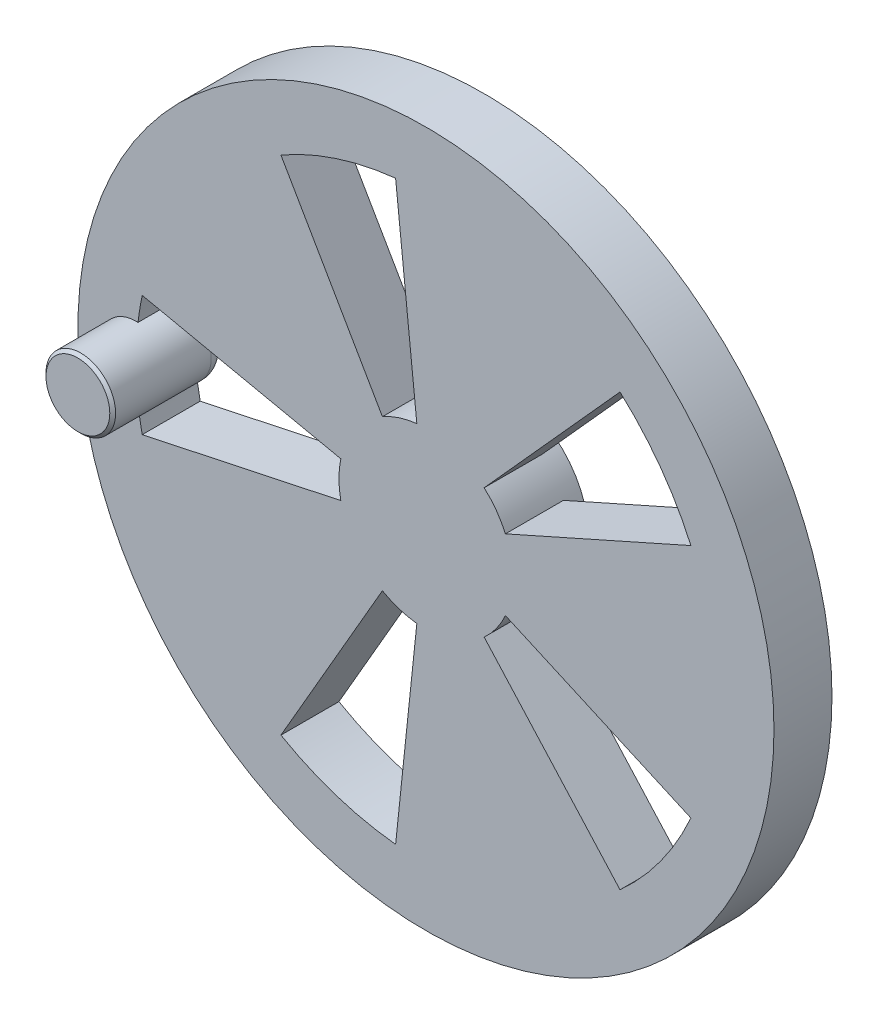
ISO-10303-21;
HEADER;
FILE_DESCRIPTION(('STEP AP214'),'2;1');
FILE_NAME('part.step','',(''),(''),'','','');
FILE_SCHEMA(('AUTOMOTIVE_DESIGN { 1 0 10303 214 1 1 1 1 }'));
ENDSEC;
DATA;
#1=APPLICATION_CONTEXT('core data for automotive mechanical design processes');
#2=APPLICATION_PROTOCOL_DEFINITION('international standard','automotive_design',2000,#1);
#3=PRODUCT_CONTEXT('',#1,'mechanical');
#4=PRODUCT('Part','Part','',(#3));
#5=PRODUCT_RELATED_PRODUCT_CATEGORY('part','',(#4));
#6=PRODUCT_DEFINITION_FORMATION('','',#4);
#7=PRODUCT_DEFINITION_CONTEXT('part definition',#1,'design');
#8=PRODUCT_DEFINITION('design','',#6,#7);
#9=PRODUCT_DEFINITION_SHAPE('','',#8);
#10=(LENGTH_UNIT() NAMED_UNIT(*) SI_UNIT(.MILLI.,.METRE.));
#11=(NAMED_UNIT(*) PLANE_ANGLE_UNIT() SI_UNIT($,.RADIAN.));
#12=(NAMED_UNIT(*) SI_UNIT($,.STERADIAN.) SOLID_ANGLE_UNIT());
#13=UNCERTAINTY_MEASURE_WITH_UNIT(LENGTH_MEASURE(1.E-05),#10,'distance_accuracy_value','');
#14=(GEOMETRIC_REPRESENTATION_CONTEXT(3) GLOBAL_UNCERTAINTY_ASSIGNED_CONTEXT((#13)) GLOBAL_UNIT_ASSIGNED_CONTEXT((#10,
#11,#12)) REPRESENTATION_CONTEXT('',''));
#15=CARTESIAN_POINT('',(0.,0.,0.));
#16=DIRECTION('',(0.,0.,1.));
#17=DIRECTION('',(1.,0.,0.));
#18=AXIS2_PLACEMENT_3D('',#15,#16,#17);
#19=CARTESIAN_POINT('',(0.,0.,-10.));
#20=DIRECTION('',(0.,0.,1.));
#21=DIRECTION('',(1.,0.,0.));
#22=AXIS2_PLACEMENT_3D('',#19,#20,#21);
#23=PLANE('',#22);
#24=CARTESIAN_POINT('',(0.,0.,-10.));
#25=DIRECTION('',(0.,0.,1.));
#26=DIRECTION('',(1.,0.,0.));
#27=AXIS2_PLACEMENT_3D('',#24,#25,#26);
#28=CIRCLE('',#27,60.);
#29=CARTESIAN_POINT('',(60.,0.,-10.));
#30=VERTEX_POINT('',#29);
#31=EDGE_CURVE('E394',#30,#30,#28,.T.);
#32=ORIENTED_EDGE('',*,*,#31,.F.);
#33=EDGE_LOOP('',(#32));
#34=FACE_BOUND('',#33,.T.);
#35=CARTESIAN_POINT('',(-50.,0.,-10.));
#36=DIRECTION('',(0.,0.,1.));
#37=DIRECTION('',(1.,0.,0.));
#38=AXIS2_PLACEMENT_3D('',#35,#36,#37);
#39=CIRCLE('',#38,3.);
#40=CARTESIAN_POINT('',(-49.91,2.99864969611323,-10.));
#41=VERTEX_POINT('',#40);
#42=CARTESIAN_POINT('',(-49.91,-2.99864969611324,-10.));
#43=VERTEX_POINT('',#42);
#44=EDGE_CURVE('E246',#41,#43,#39,.F.);
#45=ORIENTED_EDGE('',*,*,#44,.T.);
#46=CARTESIAN_POINT('',(0.,0.,-10.));
#47=DIRECTION('',(0.,0.,1.));
#48=DIRECTION('',(1.,0.,0.));
#49=AXIS2_PLACEMENT_3D('',#46,#47,#48);
#50=CIRCLE('',#49,50.);
#51=CARTESIAN_POINT('',(-48.9073800366903,-10.395584540888,-10.));
#52=VERTEX_POINT('',#51);
#53=EDGE_CURVE('E223',#43,#52,#50,.T.);
#54=ORIENTED_EDGE('',*,*,#53,.T.);
#55=DIRECTION('',(-0.978147600733806,-0.20791169081776,0.));
#56=VECTOR('',#55,1.);
#57=CARTESIAN_POINT('',(0.,0.,-10.));
#58=LINE('',#57,#56);
#59=CARTESIAN_POINT('',(-14.6722140110071,-3.11867536226639,-10.));
#60=VERTEX_POINT('',#59);
#61=EDGE_CURVE('E216',#60,#52,#58,.T.);
#62=ORIENTED_EDGE('',*,*,#61,.F.);
#63=CARTESIAN_POINT('',(0.,0.,-10.));
#64=DIRECTION('',(0.,0.,-1.));
#65=DIRECTION('',(-1.,0.,0.));
#66=AXIS2_PLACEMENT_3D('',#63,#64,#65);
#67=CIRCLE('',#66,15.);
#68=CARTESIAN_POINT('',(-7.50000000000015,-12.9903810567665,-10.));
#69=VERTEX_POINT('',#68);
#70=EDGE_CURVE('E254',#69,#60,#67,.T.);
#71=ORIENTED_EDGE('',*,*,#70,.F.);
#72=DIRECTION('',(-0.50000000000001,-0.866025403784433,0.));
#73=VECTOR('',#72,1.);
#74=CARTESIAN_POINT('',(0.,0.,-10.));
#75=LINE('',#74,#73);
#76=CARTESIAN_POINT('',(-25.0000000000005,-43.3012701892217,-10.));
#77=VERTEX_POINT('',#76);
#78=EDGE_CURVE('E325',#69,#77,#75,.T.);
#79=ORIENTED_EDGE('',*,*,#78,.T.);
#80=CARTESIAN_POINT('',(0.,0.,-10.));
#81=DIRECTION('',(0.,0.,1.));
#82=DIRECTION('',(1.,0.,0.));
#83=AXIS2_PLACEMENT_3D('',#80,#81,#82);
#84=CIRCLE('',#83,50.);
#85=CARTESIAN_POINT('',(-5.22642316338322,-49.7260947684136,-10.));
#86=VERTEX_POINT('',#85);
#87=EDGE_CURVE('E317',#77,#86,#84,.T.);
#88=ORIENTED_EDGE('',*,*,#87,.T.);
#89=DIRECTION('',(-0.104528463267664,-0.994521895368272,0.));
#90=VECTOR('',#89,1.);
#91=CARTESIAN_POINT('',(0.,0.,-10.));
#92=LINE('',#91,#90);
#93=CARTESIAN_POINT('',(-1.56792694901497,-14.9178284305241,-10.));
#94=VERTEX_POINT('',#93);
#95=EDGE_CURVE('E314',#94,#86,#92,.T.);
#96=ORIENTED_EDGE('',*,*,#95,.F.);
#97=CARTESIAN_POINT('',(10.0369590953828,-11.147172382161,-10.));
#98=VERTEX_POINT('',#97);
#99=EDGE_CURVE('E266',#98,#94,#67,.T.);
#100=ORIENTED_EDGE('',*,*,#99,.F.);
#101=DIRECTION('',(0.669130606358852,-0.7431448254774,0.));
#102=VECTOR('',#101,1.);
#103=CARTESIAN_POINT('',(0.,0.,-10.));
#104=LINE('',#103,#102);
#105=CARTESIAN_POINT('',(33.4565303179426,-37.15724127387,-10.));
#106=VERTEX_POINT('',#105);
#107=EDGE_CURVE('E301',#98,#106,#104,.T.);
#108=ORIENTED_EDGE('',*,*,#107,.T.);
#109=CARTESIAN_POINT('',(0.,0.,-10.));
#110=DIRECTION('',(0.,0.,1.));
#111=DIRECTION('',(1.,0.,0.));
#112=AXIS2_PLACEMENT_3D('',#109,#110,#111);
#113=CIRCLE('',#112,50.);
#114=CARTESIAN_POINT('',(45.6772728821299,-20.3368321537904,-10.));
#115=VERTEX_POINT('',#114);
#116=EDGE_CURVE('E293',#106,#115,#113,.T.);
#117=ORIENTED_EDGE('',*,*,#116,.T.);
#118=DIRECTION('',(0.913545457642597,-0.406736643075808,0.));
#119=VECTOR('',#118,1.);
#120=CARTESIAN_POINT('',(0.,0.,-10.));
#121=LINE('',#120,#119);
#122=CARTESIAN_POINT('',(13.703181864639,-6.10104964613712,-10.));
#123=VERTEX_POINT('',#122);
#124=EDGE_CURVE('E290',#123,#115,#121,.T.);
#125=ORIENTED_EDGE('',*,*,#124,.F.);
#126=CARTESIAN_POINT('',(13.703181864639,6.10104964613692,-10.));
#127=VERTEX_POINT('',#126);
#128=EDGE_CURVE('E247',#127,#123,#67,.T.);
#129=ORIENTED_EDGE('',*,*,#128,.F.);
#130=DIRECTION('',(0.913545457642603,0.406736643075795,0.));
#131=VECTOR('',#130,1.);
#132=CARTESIAN_POINT('',(0.,0.,-10.));
#133=LINE('',#132,#131);
#134=CARTESIAN_POINT('',(45.6772728821302,20.3368321537897,-10.));
#135=VERTEX_POINT('',#134);
#136=EDGE_CURVE('E276',#127,#135,#133,.T.);
#137=ORIENTED_EDGE('',*,*,#136,.T.);
#138=CARTESIAN_POINT('',(0.,0.,-10.));
#139=DIRECTION('',(0.,0.,1.));
#140=DIRECTION('',(1.,0.,0.));
#141=AXIS2_PLACEMENT_3D('',#138,#139,#140);
#142=CIRCLE('',#141,50.);
#143=CARTESIAN_POINT('',(33.4565303179431,37.1572412738695,-10.));
#144=VERTEX_POINT('',#143);
#145=EDGE_CURVE('E279',#135,#144,#142,.T.);
#146=ORIENTED_EDGE('',*,*,#145,.T.);
#147=DIRECTION('',(0.669130606358862,0.743144825477391,0.));
#148=VECTOR('',#147,1.);
#149=CARTESIAN_POINT('',(0.,0.,-10.));
#150=LINE('',#149,#148);
#151=CARTESIAN_POINT('',(10.0369590953829,11.1471723821609,-10.));
#152=VERTEX_POINT('',#151);
#153=EDGE_CURVE('E273',#152,#144,#150,.T.);
#154=ORIENTED_EDGE('',*,*,#153,.F.);
#155=CARTESIAN_POINT('',(-1.56792694901475,14.9178284305241,-10.));
#156=VERTEX_POINT('',#155);
#157=EDGE_CURVE('E243',#156,#152,#67,.T.);
#158=ORIENTED_EDGE('',*,*,#157,.F.);
#159=DIRECTION('',(-0.10452846326765,0.994521895368274,0.));
#160=VECTOR('',#159,1.);
#161=CARTESIAN_POINT('',(0.,0.,-10.));
#162=LINE('',#161,#160);
#163=CARTESIAN_POINT('',(-5.22642316338252,49.7260947684137,-10.));
#164=VERTEX_POINT('',#163);
#165=EDGE_CURVE('E423',#156,#164,#162,.T.);
#166=ORIENTED_EDGE('',*,*,#165,.T.);
#167=CARTESIAN_POINT('',(0.,0.,-10.));
#168=DIRECTION('',(0.,0.,1.));
#169=DIRECTION('',(1.,0.,0.));
#170=AXIS2_PLACEMENT_3D('',#167,#168,#169);
#171=CIRCLE('',#170,50.);
#172=CARTESIAN_POINT('',(-24.9999999999999,43.301270189222,-10.));
#173=VERTEX_POINT('',#172);
#174=EDGE_CURVE('E240',#164,#173,#171,.T.);
#175=ORIENTED_EDGE('',*,*,#174,.T.);
#176=DIRECTION('',(-0.499999999999998,0.86602540378444,0.));
#177=VECTOR('',#176,1.);
#178=CARTESIAN_POINT('',(0.,0.,-10.));
#179=LINE('',#178,#177);
#180=CARTESIAN_POINT('',(-7.49999999999997,12.9903810567666,-10.));
#181=VERTEX_POINT('',#180);
#182=EDGE_CURVE('E198',#181,#173,#179,.T.);
#183=ORIENTED_EDGE('',*,*,#182,.F.);
#184=CARTESIAN_POINT('',(-14.6722140110071,3.11867536226639,-10.));
#185=VERTEX_POINT('',#184);
#186=EDGE_CURVE('E192',#185,#181,#67,.T.);
#187=ORIENTED_EDGE('',*,*,#186,.F.);
#188=DIRECTION('',(-0.978147600733806,0.20791169081776,0.));
#189=VECTOR('',#188,1.);
#190=CARTESIAN_POINT('',(0.,0.,-10.));
#191=LINE('',#190,#189);
#192=CARTESIAN_POINT('',(-48.9073800366903,10.395584540888,-10.));
#193=VERTEX_POINT('',#192);
#194=EDGE_CURVE('E196',#185,#193,#191,.T.);
#195=ORIENTED_EDGE('',*,*,#194,.T.);
#196=CARTESIAN_POINT('',(0.,0.,-10.));
#197=DIRECTION('',(0.,0.,1.));
#198=DIRECTION('',(1.,0.,0.));
#199=AXIS2_PLACEMENT_3D('',#196,#197,#198);
#200=CIRCLE('',#199,50.);
#201=EDGE_CURVE('E220',#193,#41,#200,.T.);
#202=ORIENTED_EDGE('',*,*,#201,.T.);
#203=EDGE_LOOP('',(#45,#54,#62,#71,#79,#88,#96,#100,#108,#117,#125,#129,#137,#146,#154,#158,
#166,#175,#183,#187,#195,#202));
#204=FACE_BOUND('',#203,.T.);
#205=ADVANCED_FACE('F37',(#34,#204),#23,.F.);
#206=CARTESIAN_POINT('',(0.,0.,0.));
#207=DIRECTION('',(0.,0.,1.));
#208=DIRECTION('',(1.,0.,0.));
#209=AXIS2_PLACEMENT_3D('',#206,#207,#208);
#210=PLANE('',#209);
#211=DIRECTION('',(0.669130606358852,-0.7431448254774,0.));
#212=VECTOR('',#211,1.);
#213=CARTESIAN_POINT('',(0.,0.,0.));
#214=LINE('',#213,#212);
#215=CARTESIAN_POINT('',(10.0369590953828,-11.147172382161,0.));
#216=VERTEX_POINT('',#215);
#217=CARTESIAN_POINT('',(33.4565303179426,-37.15724127387,0.));
#218=VERTEX_POINT('',#217);
#219=EDGE_CURVE('E457',#216,#218,#214,.T.);
#220=ORIENTED_EDGE('',*,*,#219,.F.);
#221=CARTESIAN_POINT('',(0.,0.,0.));
#222=DIRECTION('',(0.,0.,1.));
#223=DIRECTION('',(1.,0.,0.));
#224=AXIS2_PLACEMENT_3D('',#221,#222,#223);
#225=CIRCLE('',#224,15.);
#226=CARTESIAN_POINT('',(13.703181864639,-6.10104964613712,0.));
#227=VERTEX_POINT('',#226);
#228=EDGE_CURVE('E310',#216,#227,#225,.T.);
#229=ORIENTED_EDGE('',*,*,#228,.T.);
#230=DIRECTION('',(0.913545457642597,-0.406736643075808,0.));
#231=VECTOR('',#230,1.);
#232=CARTESIAN_POINT('',(0.,0.,0.));
#233=LINE('',#232,#231);
#234=CARTESIAN_POINT('',(45.6772728821299,-20.3368321537904,0.));
#235=VERTEX_POINT('',#234);
#236=EDGE_CURVE('E304',#227,#235,#233,.T.);
#237=ORIENTED_EDGE('',*,*,#236,.T.);
#238=CARTESIAN_POINT('',(0.,0.,0.));
#239=DIRECTION('',(0.,0.,1.));
#240=DIRECTION('',(1.,0.,0.));
#241=AXIS2_PLACEMENT_3D('',#238,#239,#240);
#242=CIRCLE('',#241,50.);
#243=EDGE_CURVE('E454',#218,#235,#242,.T.);
#244=ORIENTED_EDGE('',*,*,#243,.F.);
#245=EDGE_LOOP('',(#220,#229,#237,#244));
#246=FACE_BOUND('',#245,.T.);
#247=DIRECTION('',(-0.10452846326765,0.994521895368274,0.));
#248=VECTOR('',#247,1.);
#249=CARTESIAN_POINT('',(0.,0.,0.));
#250=LINE('',#249,#248);
#251=CARTESIAN_POINT('',(-1.56792694901476,14.9178284305241,0.));
#252=VERTEX_POINT('',#251);
#253=CARTESIAN_POINT('',(-5.22642316338252,49.7260947684137,0.));
#254=VERTEX_POINT('',#253);
#255=EDGE_CURVE('E427',#252,#254,#250,.T.);
#256=ORIENTED_EDGE('',*,*,#255,.F.);
#257=CARTESIAN_POINT('',(0.,0.,0.));
#258=DIRECTION('',(0.,0.,1.));
#259=DIRECTION('',(1.,0.,0.));
#260=AXIS2_PLACEMENT_3D('',#257,#258,#259);
#261=CIRCLE('',#260,15.);
#262=CARTESIAN_POINT('',(-7.49999999999997,12.9903810567666,0.));
#263=VERTEX_POINT('',#262);
#264=EDGE_CURVE('E430',#252,#263,#261,.T.);
#265=ORIENTED_EDGE('',*,*,#264,.T.);
#266=DIRECTION('',(-0.499999999999998,0.86602540378444,0.));
#267=VECTOR('',#266,1.);
#268=CARTESIAN_POINT('',(0.,0.,0.));
#269=LINE('',#268,#267);
#270=CARTESIAN_POINT('',(-24.9999999999999,43.301270189222,0.));
#271=VERTEX_POINT('',#270);
#272=EDGE_CURVE('E420',#263,#271,#269,.T.);
#273=ORIENTED_EDGE('',*,*,#272,.T.);
#274=CARTESIAN_POINT('',(0.,0.,0.));
#275=DIRECTION('',(0.,0.,1.));
#276=DIRECTION('',(1.,0.,0.));
#277=AXIS2_PLACEMENT_3D('',#274,#275,#276);
#278=CIRCLE('',#277,50.);
#279=EDGE_CURVE('E424',#254,#271,#278,.T.);
#280=ORIENTED_EDGE('',*,*,#279,.F.);
#281=EDGE_LOOP('',(#256,#265,#273,#280));
#282=FACE_BOUND('',#281,.T.);
#283=CARTESIAN_POINT('',(0.,0.,0.));
#284=DIRECTION('',(0.,0.,1.));
#285=DIRECTION('',(1.,0.,0.));
#286=AXIS2_PLACEMENT_3D('',#283,#284,#285);
#287=CIRCLE('',#286,50.);
#288=CARTESIAN_POINT('',(-49.64,-5.98919026246454,0.));
#289=VERTEX_POINT('',#288);
#290=CARTESIAN_POINT('',(-48.9073800366903,-10.395584540888,0.));
#291=VERTEX_POINT('',#290);
#292=EDGE_CURVE('E226',#289,#291,#287,.T.);
#293=ORIENTED_EDGE('',*,*,#292,.F.);
#294=CARTESIAN_POINT('',(-50.,0.,0.));
#295=DIRECTION('',(0.,0.,1.));
#296=DIRECTION('',(1.,0.,0.));
#297=AXIS2_PLACEMENT_3D('',#294,#295,#296);
#298=CIRCLE('',#297,6.);
#299=CARTESIAN_POINT('',(-49.64,5.98919026246453,0.));
#300=VERTEX_POINT('',#299);
#301=EDGE_CURVE('E396',#300,#289,#298,.T.);
#302=ORIENTED_EDGE('',*,*,#301,.F.);
#303=CARTESIAN_POINT('',(0.,0.,0.));
#304=DIRECTION('',(0.,0.,1.));
#305=DIRECTION('',(1.,0.,0.));
#306=AXIS2_PLACEMENT_3D('',#303,#304,#305);
#307=CIRCLE('',#306,50.);
#308=CARTESIAN_POINT('',(-48.9073800366903,10.395584540888,0.));
#309=VERTEX_POINT('',#308);
#310=EDGE_CURVE('E410',#309,#300,#307,.T.);
#311=ORIENTED_EDGE('',*,*,#310,.F.);
#312=DIRECTION('',(-0.978147600733806,0.20791169081776,0.));
#313=VECTOR('',#312,1.);
#314=CARTESIAN_POINT('',(0.,0.,0.));
#315=LINE('',#314,#313);
#316=CARTESIAN_POINT('',(-14.6722140110071,3.11867536226639,0.));
#317=VERTEX_POINT('',#316);
#318=EDGE_CURVE('E412',#317,#309,#315,.T.);
#319=ORIENTED_EDGE('',*,*,#318,.F.);
#320=CARTESIAN_POINT('',(0.,0.,0.));
#321=DIRECTION('',(0.,0.,1.));
#322=DIRECTION('',(1.,0.,0.));
#323=AXIS2_PLACEMENT_3D('',#320,#321,#322);
#324=CIRCLE('',#323,15.);
#325=CARTESIAN_POINT('',(-14.6722140110071,-3.11867536226639,0.));
#326=VERTEX_POINT('',#325);
#327=EDGE_CURVE('E211',#317,#326,#324,.T.);
#328=ORIENTED_EDGE('',*,*,#327,.T.);
#329=DIRECTION('',(-0.978147600733806,-0.20791169081776,0.));
#330=VECTOR('',#329,1.);
#331=CARTESIAN_POINT('',(0.,0.,0.));
#332=LINE('',#331,#330);
#333=EDGE_CURVE('E221',#326,#291,#332,.T.);
#334=ORIENTED_EDGE('',*,*,#333,.T.);
#335=EDGE_LOOP('',(#293,#302,#311,#319,#328,#334));
#336=FACE_BOUND('',#335,.T.);
#337=CARTESIAN_POINT('',(0.,0.,0.));
#338=DIRECTION('',(0.,0.,1.));
#339=DIRECTION('',(1.,0.,0.));
#340=AXIS2_PLACEMENT_3D('',#337,#338,#339);
#341=CIRCLE('',#340,60.);
#342=CARTESIAN_POINT('',(60.,0.,0.));
#343=VERTEX_POINT('',#342);
#344=EDGE_CURVE('E252',#343,#343,#341,.T.);
#345=ORIENTED_EDGE('',*,*,#344,.T.);
#346=EDGE_LOOP('',(#345));
#347=FACE_BOUND('',#346,.T.);
#348=DIRECTION('',(0.913545457642603,0.406736643075795,0.));
#349=VECTOR('',#348,1.);
#350=CARTESIAN_POINT('',(0.,0.,0.));
#351=LINE('',#350,#349);
#352=CARTESIAN_POINT('',(13.703181864639,6.10104964613692,0.));
#353=VERTEX_POINT('',#352);
#354=CARTESIAN_POINT('',(45.6772728821302,20.3368321537897,0.));
#355=VERTEX_POINT('',#354);
#356=EDGE_CURVE('E443',#353,#355,#351,.T.);
#357=ORIENTED_EDGE('',*,*,#356,.F.);
#358=CARTESIAN_POINT('',(0.,0.,0.));
#359=DIRECTION('',(0.,0.,1.));
#360=DIRECTION('',(1.,0.,0.));
#361=AXIS2_PLACEMENT_3D('',#358,#359,#360);
#362=CIRCLE('',#361,15.);
#363=CARTESIAN_POINT('',(10.0369590953829,11.1471723821609,0.));
#364=VERTEX_POINT('',#363);
#365=EDGE_CURVE('E286',#353,#364,#362,.T.);
#366=ORIENTED_EDGE('',*,*,#365,.T.);
#367=DIRECTION('',(0.669130606358862,0.743144825477391,0.));
#368=VECTOR('',#367,1.);
#369=CARTESIAN_POINT('',(0.,0.,0.));
#370=LINE('',#369,#368);
#371=CARTESIAN_POINT('',(33.4565303179431,37.1572412738695,0.));
#372=VERTEX_POINT('',#371);
#373=EDGE_CURVE('E280',#364,#372,#370,.T.);
#374=ORIENTED_EDGE('',*,*,#373,.T.);
#375=CARTESIAN_POINT('',(0.,0.,0.));
#376=DIRECTION('',(0.,0.,1.));
#377=DIRECTION('',(1.,0.,0.));
#378=AXIS2_PLACEMENT_3D('',#375,#376,#377);
#379=CIRCLE('',#378,50.);
#380=EDGE_CURVE('E440',#355,#372,#379,.T.);
#381=ORIENTED_EDGE('',*,*,#380,.F.);
#382=EDGE_LOOP('',(#357,#366,#374,#381));
#383=FACE_BOUND('',#382,.T.);
#384=DIRECTION('',(-0.50000000000001,-0.866025403784433,0.));
#385=VECTOR('',#384,1.);
#386=CARTESIAN_POINT('',(0.,0.,0.));
#387=LINE('',#386,#385);
#388=CARTESIAN_POINT('',(-7.50000000000015,-12.9903810567665,0.));
#389=VERTEX_POINT('',#388);
#390=CARTESIAN_POINT('',(-25.0000000000005,-43.3012701892217,0.));
#391=VERTEX_POINT('',#390);
#392=EDGE_CURVE('E471',#389,#391,#387,.T.);
#393=ORIENTED_EDGE('',*,*,#392,.F.);
#394=CARTESIAN_POINT('',(0.,0.,0.));
#395=DIRECTION('',(0.,0.,1.));
#396=DIRECTION('',(1.,0.,0.));
#397=AXIS2_PLACEMENT_3D('',#394,#395,#396);
#398=CIRCLE('',#397,15.);
#399=CARTESIAN_POINT('',(-1.56792694901497,-14.9178284305241,0.));
#400=VERTEX_POINT('',#399);
#401=EDGE_CURVE('E474',#389,#400,#398,.T.);
#402=ORIENTED_EDGE('',*,*,#401,.T.);
#403=DIRECTION('',(-0.104528463267664,-0.994521895368272,0.));
#404=VECTOR('',#403,1.);
#405=CARTESIAN_POINT('',(0.,0.,0.));
#406=LINE('',#405,#404);
#407=CARTESIAN_POINT('',(-5.22642316338322,-49.7260947684136,0.));
#408=VERTEX_POINT('',#407);
#409=EDGE_CURVE('E328',#400,#408,#406,.T.);
#410=ORIENTED_EDGE('',*,*,#409,.T.);
#411=CARTESIAN_POINT('',(0.,0.,0.));
#412=DIRECTION('',(0.,0.,1.));
#413=DIRECTION('',(1.,0.,0.));
#414=AXIS2_PLACEMENT_3D('',#411,#412,#413);
#415=CIRCLE('',#414,50.);
#416=EDGE_CURVE('E468',#391,#408,#415,.T.);
#417=ORIENTED_EDGE('',*,*,#416,.F.);
#418=EDGE_LOOP('',(#393,#402,#410,#417));
#419=FACE_BOUND('',#418,.T.);
#420=ADVANCED_FACE('F359',(#246,#282,#336,#347,#383,#419),#210,.T.);
#421=CARTESIAN_POINT('',(0.,0.,-10.));
#422=DIRECTION('',(0.,0.,1.));
#423=DIRECTION('',(1.,0.,0.));
#424=AXIS2_PLACEMENT_3D('',#421,#422,#423);
#425=CYLINDRICAL_SURFACE('',#424,60.);
#426=ORIENTED_EDGE('',*,*,#31,.T.);
#427=EDGE_LOOP('',(#426));
#428=FACE_BOUND('',#427,.T.);
#429=ORIENTED_EDGE('',*,*,#344,.F.);
#430=EDGE_LOOP('',(#429));
#431=FACE_BOUND('',#430,.T.);
#432=ADVANCED_FACE('F354',(#428,#431),#425,.T.);
#433=CARTESIAN_POINT('',(-50.,0.,10.));
#434=DIRECTION('',(0.,0.,-1.));
#435=DIRECTION('',(-1.,0.,0.));
#436=AXIS2_PLACEMENT_3D('',#433,#434,#435);
#437=CYLINDRICAL_SURFACE('',#436,6.);
#438=CARTESIAN_POINT('',(-50.,0.,9.50000000000002));
#439=DIRECTION('',(0.,0.,1.));
#440=DIRECTION('',(1.,0.,0.));
#441=AXIS2_PLACEMENT_3D('',#438,#439,#440);
#442=CIRCLE('',#441,6.);
#443=CARTESIAN_POINT('',(-44.,0.,9.50000000000002));
#444=VERTEX_POINT('',#443);
#445=EDGE_CURVE('E11',#444,#444,#442,.F.);
#446=ORIENTED_EDGE('',*,*,#445,.T.);
#447=EDGE_LOOP('',(#446));
#448=FACE_BOUND('',#447,.T.);
#449=DIRECTION('',(0.,0.,1.));
#450=VECTOR('',#449,1.);
#451=CARTESIAN_POINT('',(-49.64,-5.98919026246454,-10.));
#452=LINE('',#451,#450);
#453=CARTESIAN_POINT('',(-49.64,-5.98919026246454,-7.));
#454=VERTEX_POINT('',#453);
#455=EDGE_CURVE('E404',#454,#289,#452,.T.);
#456=ORIENTED_EDGE('',*,*,#455,.F.);
#457=CARTESIAN_POINT('',(-50.,0.,-7.));
#458=DIRECTION('',(0.,0.,1.));
#459=DIRECTION('',(1.,0.,0.));
#460=AXIS2_PLACEMENT_3D('',#457,#458,#459);
#461=CIRCLE('',#460,6.);
#462=CARTESIAN_POINT('',(-49.64,5.98919026246453,-7.));
#463=VERTEX_POINT('',#462);
#464=EDGE_CURVE('E52',#454,#463,#461,.T.);
#465=ORIENTED_EDGE('',*,*,#464,.T.);
#466=DIRECTION('',(0.,0.,1.));
#467=VECTOR('',#466,1.);
#468=CARTESIAN_POINT('',(-49.64,5.98919026246453,-10.));
#469=LINE('',#468,#467);
#470=EDGE_CURVE('E402',#463,#300,#469,.T.);
#471=ORIENTED_EDGE('',*,*,#470,.T.);
#472=ORIENTED_EDGE('',*,*,#301,.T.);
#473=EDGE_LOOP('',(#456,#465,#471,#472));
#474=FACE_BOUND('',#473,.T.);
#475=ADVANCED_FACE('F358',(#448,#474),#437,.T.);
#476=CARTESIAN_POINT('',(0.,0.,10.));
#477=DIRECTION('',(0.,0.,1.));
#478=DIRECTION('',(1.,0.,0.));
#479=AXIS2_PLACEMENT_3D('',#476,#477,#478);
#480=PLANE('',#479);
#481=CARTESIAN_POINT('',(-50.,0.,10.));
#482=DIRECTION('',(0.,0.,1.));
#483=DIRECTION('',(1.,0.,0.));
#484=AXIS2_PLACEMENT_3D('',#481,#482,#483);
#485=CIRCLE('',#484,5.50000000000002);
#486=CARTESIAN_POINT('',(-44.5,0.,10.));
#487=VERTEX_POINT('',#486);
#488=EDGE_CURVE('E45',#487,#487,#485,.T.);
#489=ORIENTED_EDGE('',*,*,#488,.T.);
#490=EDGE_LOOP('',(#489));
#491=FACE_BOUND('',#490,.T.);
#492=ADVANCED_FACE('F370',(#491),#480,.T.);
#493=CARTESIAN_POINT('',(0.,0.,-10.));
#494=DIRECTION('',(0.,0.,1.));
#495=DIRECTION('',(1.,0.,0.));
#496=AXIS2_PLACEMENT_3D('',#493,#494,#495);
#497=CYLINDRICAL_SURFACE('',#496,15.);
#498=ORIENTED_EDGE('',*,*,#327,.F.);
#499=DIRECTION('',(0.,0.,1.));
#500=VECTOR('',#499,1.);
#501=CARTESIAN_POINT('',(-14.6722140110071,3.11867536226639,-10.));
#502=LINE('',#501,#500);
#503=EDGE_CURVE('E206',#185,#317,#502,.T.);
#504=ORIENTED_EDGE('',*,*,#503,.F.);
#505=ORIENTED_EDGE('',*,*,#186,.T.);
#506=DIRECTION('',(0.,0.,1.));
#507=VECTOR('',#506,1.);
#508=CARTESIAN_POINT('',(-7.49999999999997,12.9903810567666,-10.));
#509=LINE('',#508,#507);
#510=EDGE_CURVE('E233',#181,#263,#509,.T.);
#511=ORIENTED_EDGE('',*,*,#510,.T.);
#512=ORIENTED_EDGE('',*,*,#264,.F.);
#513=DIRECTION('',(0.,0.,1.));
#514=VECTOR('',#513,1.);
#515=CARTESIAN_POINT('',(-1.56792694901476,14.9178284305241,-10.));
#516=LINE('',#515,#514);
#517=EDGE_CURVE('E239',#156,#252,#516,.T.);
#518=ORIENTED_EDGE('',*,*,#517,.F.);
#519=ORIENTED_EDGE('',*,*,#157,.T.);
#520=DIRECTION('',(0.,0.,1.));
#521=VECTOR('',#520,1.);
#522=CARTESIAN_POINT('',(10.0369590953829,11.1471723821609,-10.));
#523=LINE('',#522,#521);
#524=EDGE_CURVE('E433',#152,#364,#523,.T.);
#525=ORIENTED_EDGE('',*,*,#524,.T.);
#526=ORIENTED_EDGE('',*,*,#365,.F.);
#527=DIRECTION('',(0.,0.,1.));
#528=VECTOR('',#527,1.);
#529=CARTESIAN_POINT('',(13.703181864639,6.10104964613692,-10.));
#530=LINE('',#529,#528);
#531=EDGE_CURVE('E269',#127,#353,#530,.T.);
#532=ORIENTED_EDGE('',*,*,#531,.F.);
#533=ORIENTED_EDGE('',*,*,#128,.T.);
#534=DIRECTION('',(0.,0.,1.));
#535=VECTOR('',#534,1.);
#536=CARTESIAN_POINT('',(13.703181864639,-6.10104964613712,-10.));
#537=LINE('',#536,#535);
#538=EDGE_CURVE('E283',#123,#227,#537,.T.);
#539=ORIENTED_EDGE('',*,*,#538,.T.);
#540=ORIENTED_EDGE('',*,*,#228,.F.);
#541=DIRECTION('',(0.,0.,1.));
#542=VECTOR('',#541,1.);
#543=CARTESIAN_POINT('',(10.0369590953828,-11.147172382161,-10.));
#544=LINE('',#543,#542);
#545=EDGE_CURVE('E292',#98,#216,#544,.T.);
#546=ORIENTED_EDGE('',*,*,#545,.F.);
#547=ORIENTED_EDGE('',*,*,#99,.T.);
#548=DIRECTION('',(0.,0.,1.));
#549=VECTOR('',#548,1.);
#550=CARTESIAN_POINT('',(-1.56792694901497,-14.9178284305241,-10.));
#551=LINE('',#550,#549);
#552=EDGE_CURVE('E307',#94,#400,#551,.T.);
#553=ORIENTED_EDGE('',*,*,#552,.T.);
#554=ORIENTED_EDGE('',*,*,#401,.F.);
#555=DIRECTION('',(0.,0.,1.));
#556=VECTOR('',#555,1.);
#557=CARTESIAN_POINT('',(-7.50000000000015,-12.9903810567665,-10.));
#558=LINE('',#557,#556);
#559=EDGE_CURVE('E316',#69,#389,#558,.T.);
#560=ORIENTED_EDGE('',*,*,#559,.F.);
#561=ORIENTED_EDGE('',*,*,#70,.T.);
#562=DIRECTION('',(0.,0.,1.));
#563=VECTOR('',#562,1.);
#564=CARTESIAN_POINT('',(-14.6722140110071,-3.11867536226639,-10.));
#565=LINE('',#564,#563);
#566=EDGE_CURVE('E400',#60,#326,#565,.T.);
#567=ORIENTED_EDGE('',*,*,#566,.T.);
#568=EDGE_LOOP('',(#498,#504,#505,#511,#512,#518,#519,#525,#526,#532,#533,#539,#540,#546,#547,
#553,#554,#560,#561,#567));
#569=FACE_BOUND('',#568,.T.);
#570=CARTESIAN_POINT('',(0.,0.,-13.));
#571=DIRECTION('',(0.,0.,-1.));
#572=DIRECTION('',(-1.,0.,0.));
#573=AXIS2_PLACEMENT_3D('',#570,#571,#572);
#574=CIRCLE('',#573,15.);
#575=CARTESIAN_POINT('',(-15.,0.,-13.));
#576=VERTEX_POINT('',#575);
#577=EDGE_CURVE('E202',#576,#576,#574,.T.);
#578=ORIENTED_EDGE('',*,*,#577,.F.);
#579=EDGE_LOOP('',(#578));
#580=FACE_BOUND('',#579,.T.);
#581=ADVANCED_FACE('F207',(#569,#580),#497,.T.);
#582=CARTESIAN_POINT('',(0.,0.,-10.));
#583=DIRECTION('',(-0.20791169081776,0.978147600733806,0.));
#584=DIRECTION('',(-0.978147600733806,-0.20791169081776,0.));
#585=AXIS2_PLACEMENT_3D('',#582,#583,#584);
#586=PLANE('',#585);
#587=ORIENTED_EDGE('',*,*,#333,.F.);
#588=ORIENTED_EDGE('',*,*,#566,.F.);
#589=ORIENTED_EDGE('',*,*,#61,.T.);
#590=DIRECTION('',(0.,0.,1.));
#591=VECTOR('',#590,1.);
#592=CARTESIAN_POINT('',(-48.9073800366903,-10.395584540888,-10.));
#593=LINE('',#592,#591);
#594=EDGE_CURVE('E406',#52,#291,#593,.T.);
#595=ORIENTED_EDGE('',*,*,#594,.T.);
#596=EDGE_LOOP('',(#587,#588,#589,#595));
#597=FACE_BOUND('',#596,.T.);
#598=ADVANCED_FACE('F377',(#597),#586,.T.);
#599=CARTESIAN_POINT('',(0.,0.,-10.));
#600=DIRECTION('',(0.,0.,1.));
#601=DIRECTION('',(1.,0.,0.));
#602=AXIS2_PLACEMENT_3D('',#599,#600,#601);
#603=CYLINDRICAL_SURFACE('',#602,50.);
#604=ORIENTED_EDGE('',*,*,#292,.T.);
#605=ORIENTED_EDGE('',*,*,#594,.F.);
#606=ORIENTED_EDGE('',*,*,#53,.F.);
#607=CARTESIAN_POINT('',(-49.91,-2.99864969611324,-10.));
#608=CARTESIAN_POINT('',(-49.9049439261201,-3.08283828240311,-10.0000080261545));
#609=CARTESIAN_POINT('',(-49.8996709917012,-3.16700982244874,-9.99644659099964));
#610=CARTESIAN_POINT('',(-49.8887424101487,-3.33472461902902,-9.98224865413187));
#611=CARTESIAN_POINT('',(-49.8830867837929,-3.41826790940086,-9.97161253625779));
#612=CARTESIAN_POINT('',(-49.8714479036212,-3.58407522679976,-9.94334033966311));
#613=CARTESIAN_POINT('',(-49.8654649143171,-3.66634021965269,-9.92570984250697));
#614=CARTESIAN_POINT('',(-49.8532349759121,-3.82905117788364,-9.88359263299933));
#615=CARTESIAN_POINT('',(-49.8469880295548,-3.90949716215579,-9.85910599189832));
#616=CARTESIAN_POINT('',(-49.8279504472325,-4.14735407131171,-9.77555350593668));
#617=CARTESIAN_POINT('',(-49.8148597643039,-4.30133055344997,-9.70638710933042));
#618=CARTESIAN_POINT('',(-49.7886003267332,-4.59533949933621,-9.54318933856932));
#619=CARTESIAN_POINT('',(-49.7754315846134,-4.7353741387369,-9.44916185243612));
#620=CARTESIAN_POINT('',(-49.7497635030993,-4.99784438320812,-9.23875116938753));
#621=CARTESIAN_POINT('',(-49.7372648810117,-5.12026135707965,-9.12234460533485));
#622=CARTESIAN_POINT('',(-49.7137381005814,-5.34386813256187,-8.87050513833052));
#623=CARTESIAN_POINT('',(-49.702710224116,-5.4450538672016,-8.73506859835397));
#624=CARTESIAN_POINT('',(-49.6828557998227,-5.62333653564696,-8.44901443670057));
#625=CARTESIAN_POINT('',(-49.6740295779072,-5.70042990347099,-8.29839457205487));
#626=CARTESIAN_POINT('',(-49.6591894871452,-5.82829900047332,-7.98628314545148));
#627=CARTESIAN_POINT('',(-49.6531739491007,-5.87909035173748,-7.82479810142491));
#628=CARTESIAN_POINT('',(-49.6458757110523,-5.94033857795905,-7.55194075310206));
#629=CARTESIAN_POINT('',(-49.6436782669931,-5.95864650498872,-7.44229015184943));
#630=CARTESIAN_POINT('',(-49.6407383562996,-5.9830709625651,-7.22177517702193));
#631=CARTESIAN_POINT('',(-49.6399938687051,-5.98920442713467,-7.11091270536823));
#632=CARTESIAN_POINT('',(-49.64,-5.98919026246454,-7.));
#633=B_SPLINE_CURVE_WITH_KNOTS('',3,(#607,#608,#609,#610,#611,#612,#613,#614,#615,#616,#617,
#618,#619,#620,#621,#622,#623,#624,#625,#626,#627,#628,#629,#630,#631,#632),.UNSPECIFIED.,.F.,
.F.,(4,2,2,2,2,2,2,2,2,2,2,2,4),(0.,0.252938208683098,0.505862695254439,0.758585750974307,
1.01130618044091,1.51660664028883,2.02182812297562,2.5275800268003,3.03342872216216,
3.53935225424424,4.04497494732986,4.37790687131697,4.71037537947205),.UNSPECIFIED.);
#634=EDGE_CURVE('E60',#43,#454,#633,.T.);
#635=ORIENTED_EDGE('',*,*,#634,.T.);
#636=ORIENTED_EDGE('',*,*,#455,.T.);
#637=EDGE_LOOP('',(#604,#605,#606,#635,#636));
#638=FACE_BOUND('',#637,.T.);
#639=ADVANCED_FACE('F345',(#638),#603,.F.);
#640=CARTESIAN_POINT('',(0.,0.,-10.));
#641=DIRECTION('',(0.,0.,1.));
#642=DIRECTION('',(1.,0.,0.));
#643=AXIS2_PLACEMENT_3D('',#640,#641,#642);
#644=CYLINDRICAL_SURFACE('',#643,50.);
#645=ORIENTED_EDGE('',*,*,#310,.T.);
#646=ORIENTED_EDGE('',*,*,#470,.F.);
#647=CARTESIAN_POINT('',(-49.64,5.98919026246453,-7.));
#648=CARTESIAN_POINT('',(-49.63999743579,5.98919824657188,-7.08428454445953));
#649=CARTESIAN_POINT('',(-49.640426187557,5.98565756079732,-7.16856518169904));
#650=CARTESIAN_POINT('',(-49.6421272136668,5.9715406956767,-7.33652226825154));
#651=CARTESIAN_POINT('',(-49.643399443212,5.96096488996999,-7.42019874941305));
#652=CARTESIAN_POINT('',(-49.6467669407055,5.93285112805602,-7.58629223340555));
#653=CARTESIAN_POINT('',(-49.6488615342127,5.91531887687881,-7.66871021096862));
#654=CARTESIAN_POINT('',(-49.6538338628285,5.87343368159508,-7.83174551622997));
#655=CARTESIAN_POINT('',(-49.6567115891929,5.84908081364612,-7.91236286402285));
#656=CARTESIAN_POINT('',(-49.6664529100317,5.76598795446486,-8.15073288734015));
#657=CARTESIAN_POINT('',(-49.6744261536817,5.69720151128906,-8.3050752241517));
#658=CARTESIAN_POINT('',(-49.6927729917034,5.53488351403416,-8.59984936654554));
#659=CARTESIAN_POINT('',(-49.7031462125561,5.44135581022291,-8.74028333189751));
#660=CARTESIAN_POINT('',(-49.7256140344055,5.23205206676981,-9.00354478378812));
#661=CARTESIAN_POINT('',(-49.7377102278546,5.11625541005686,-9.12635576916527));
#662=CARTESIAN_POINT('',(-49.7628453990545,4.86569980549803,-9.35074503669097));
#663=CARTESIAN_POINT('',(-49.775884563508,4.73093709746237,-9.45231909847905));
#664=CARTESIAN_POINT('',(-49.8021358586142,4.44609122307307,-9.63145745765537));
#665=CARTESIAN_POINT('',(-49.8153481860945,4.29598901059886,-9.70899141227564));
#666=CARTESIAN_POINT('',(-49.8411997573412,3.98485950578252,-9.83764748485776));
#667=CARTESIAN_POINT('',(-49.8538393333207,3.82383868545918,-9.88878509710367));
#668=CARTESIAN_POINT('',(-49.8738406211148,3.55131852571428,-9.95059378669125));
#669=CARTESIAN_POINT('',(-49.8815377433552,3.44155840847316,-9.96910839396334));
#670=CARTESIAN_POINT('',(-49.8962822104078,3.22077188628861,-9.99381024773445));
#671=CARTESIAN_POINT('',(-49.9033304414563,3.10974744834594,-10.0000145528089));
#672=CARTESIAN_POINT('',(-49.91,2.99864969611323,-10.));
#673=B_SPLINE_CURVE_WITH_KNOTS('',3,(#647,#648,#649,#650,#651,#652,#653,#654,#655,#656,#657,
#658,#659,#660,#661,#662,#663,#664,#665,#666,#667,#668,#669,#670,#671,#672),.UNSPECIFIED.,.F.,
.F.,(4,2,2,2,2,2,2,2,2,2,2,2,4),(0.,0.252771172147322,0.505528920540988,0.758079807552228,
1.01062787474615,1.51550857587028,2.02031075296332,2.52558255640789,3.03095467600807,
3.53696209006096,4.04267214610286,4.37675736898042,4.71037932059617),.UNSPECIFIED.);
#674=EDGE_CURVE('E339',#463,#41,#673,.T.);
#675=ORIENTED_EDGE('',*,*,#674,.T.);
#676=ORIENTED_EDGE('',*,*,#201,.F.);
#677=DIRECTION('',(0.,0.,1.));
#678=VECTOR('',#677,1.);
#679=CARTESIAN_POINT('',(-48.9073800366903,10.395584540888,-10.));
#680=LINE('',#679,#678);
#681=EDGE_CURVE('E215',#193,#309,#680,.T.);
#682=ORIENTED_EDGE('',*,*,#681,.T.);
#683=EDGE_LOOP('',(#645,#646,#675,#676,#682));
#684=FACE_BOUND('',#683,.T.);
#685=ADVANCED_FACE('F380',(#684),#644,.F.);
#686=CARTESIAN_POINT('',(0.,0.,-10.));
#687=DIRECTION('',(0.20791169081776,0.978147600733806,0.));
#688=DIRECTION('',(-0.978147600733806,0.20791169081776,0.));
#689=AXIS2_PLACEMENT_3D('',#686,#687,#688);
#690=PLANE('',#689);
#691=ORIENTED_EDGE('',*,*,#318,.T.);
#692=ORIENTED_EDGE('',*,*,#681,.F.);
#693=ORIENTED_EDGE('',*,*,#194,.F.);
#694=ORIENTED_EDGE('',*,*,#503,.T.);
#695=EDGE_LOOP('',(#691,#692,#693,#694));
#696=FACE_BOUND('',#695,.T.);
#697=ADVANCED_FACE('F219',(#696),#690,.F.);
#698=CARTESIAN_POINT('',(0.,0.,-10.));
#699=DIRECTION('',(0.86602540378444,0.499999999999998,0.));
#700=DIRECTION('',(-0.499999999999998,0.86602540378444,0.));
#701=AXIS2_PLACEMENT_3D('',#698,#699,#700);
#702=PLANE('',#701);
#703=ORIENTED_EDGE('',*,*,#272,.F.);
#704=ORIENTED_EDGE('',*,*,#510,.F.);
#705=ORIENTED_EDGE('',*,*,#182,.T.);
#706=DIRECTION('',(0.,0.,1.));
#707=VECTOR('',#706,1.);
#708=CARTESIAN_POINT('',(-24.9999999999999,43.301270189222,-10.));
#709=LINE('',#708,#707);
#710=EDGE_CURVE('E235',#173,#271,#709,.T.);
#711=ORIENTED_EDGE('',*,*,#710,.T.);
#712=EDGE_LOOP('',(#703,#704,#705,#711));
#713=FACE_BOUND('',#712,.T.);
#714=ADVANCED_FACE('F379',(#713),#702,.T.);
#715=CARTESIAN_POINT('',(0.,0.,-10.));
#716=DIRECTION('',(0.,0.,1.));
#717=DIRECTION('',(1.,0.,0.));
#718=AXIS2_PLACEMENT_3D('',#715,#716,#717);
#719=CYLINDRICAL_SURFACE('',#718,50.);
#720=ORIENTED_EDGE('',*,*,#279,.T.);
#721=ORIENTED_EDGE('',*,*,#710,.F.);
#722=ORIENTED_EDGE('',*,*,#174,.F.);
#723=DIRECTION('',(0.,0.,1.));
#724=VECTOR('',#723,1.);
#725=CARTESIAN_POINT('',(-5.22642316338252,49.7260947684137,-10.));
#726=LINE('',#725,#724);
#727=EDGE_CURVE('E417',#164,#254,#726,.T.);
#728=ORIENTED_EDGE('',*,*,#727,.T.);
#729=EDGE_LOOP('',(#720,#721,#722,#728));
#730=FACE_BOUND('',#729,.T.);
#731=ADVANCED_FACE('F537',(#730),#719,.F.);
#732=CARTESIAN_POINT('',(0.,0.,-10.));
#733=DIRECTION('',(0.994521895368274,0.10452846326765,0.));
#734=DIRECTION('',(-0.10452846326765,0.994521895368274,0.));
#735=AXIS2_PLACEMENT_3D('',#732,#733,#734);
#736=PLANE('',#735);
#737=ORIENTED_EDGE('',*,*,#255,.T.);
#738=ORIENTED_EDGE('',*,*,#727,.F.);
#739=ORIENTED_EDGE('',*,*,#165,.F.);
#740=ORIENTED_EDGE('',*,*,#517,.T.);
#741=EDGE_LOOP('',(#737,#738,#739,#740));
#742=FACE_BOUND('',#741,.T.);
#743=ADVANCED_FACE('F533',(#742),#736,.F.);
#744=CARTESIAN_POINT('',(0.,0.,-10.));
#745=DIRECTION('',(0.743144825477391,-0.669130606358862,0.));
#746=DIRECTION('',(0.669130606358862,0.743144825477391,0.));
#747=AXIS2_PLACEMENT_3D('',#744,#745,#746);
#748=PLANE('',#747);
#749=ORIENTED_EDGE('',*,*,#373,.F.);
#750=ORIENTED_EDGE('',*,*,#524,.F.);
#751=ORIENTED_EDGE('',*,*,#153,.T.);
#752=DIRECTION('',(0.,0.,1.));
#753=VECTOR('',#752,1.);
#754=CARTESIAN_POINT('',(33.4565303179431,37.1572412738695,-10.));
#755=LINE('',#754,#753);
#756=EDGE_CURVE('E436',#144,#372,#755,.T.);
#757=ORIENTED_EDGE('',*,*,#756,.T.);
#758=EDGE_LOOP('',(#749,#750,#751,#757));
#759=FACE_BOUND('',#758,.T.);
#760=ADVANCED_FACE('F547',(#759),#748,.T.);
#761=CARTESIAN_POINT('',(0.,0.,-10.));
#762=DIRECTION('',(0.,0.,1.));
#763=DIRECTION('',(1.,0.,0.));
#764=AXIS2_PLACEMENT_3D('',#761,#762,#763);
#765=CYLINDRICAL_SURFACE('',#764,50.);
#766=ORIENTED_EDGE('',*,*,#380,.T.);
#767=ORIENTED_EDGE('',*,*,#756,.F.);
#768=ORIENTED_EDGE('',*,*,#145,.F.);
#769=DIRECTION('',(0.,0.,1.));
#770=VECTOR('',#769,1.);
#771=CARTESIAN_POINT('',(45.6772728821302,20.3368321537897,-10.));
#772=LINE('',#771,#770);
#773=EDGE_CURVE('E272',#135,#355,#772,.T.);
#774=ORIENTED_EDGE('',*,*,#773,.T.);
#775=EDGE_LOOP('',(#766,#767,#768,#774));
#776=FACE_BOUND('',#775,.T.);
#777=ADVANCED_FACE('F515',(#776),#765,.F.);
#778=CARTESIAN_POINT('',(0.,0.,-10.));
#779=DIRECTION('',(0.406736643075795,-0.913545457642603,0.));
#780=DIRECTION('',(0.913545457642603,0.406736643075795,0.));
#781=AXIS2_PLACEMENT_3D('',#778,#779,#780);
#782=PLANE('',#781);
#783=ORIENTED_EDGE('',*,*,#356,.T.);
#784=ORIENTED_EDGE('',*,*,#773,.F.);
#785=ORIENTED_EDGE('',*,*,#136,.F.);
#786=ORIENTED_EDGE('',*,*,#531,.T.);
#787=EDGE_LOOP('',(#783,#784,#785,#786));
#788=FACE_BOUND('',#787,.T.);
#789=ADVANCED_FACE('F512',(#788),#782,.F.);
#790=CARTESIAN_POINT('',(0.,0.,-10.));
#791=DIRECTION('',(-0.406736643075808,-0.913545457642597,0.));
#792=DIRECTION('',(0.913545457642597,-0.406736643075808,0.));
#793=AXIS2_PLACEMENT_3D('',#790,#791,#792);
#794=PLANE('',#793);
#795=ORIENTED_EDGE('',*,*,#236,.F.);
#796=ORIENTED_EDGE('',*,*,#538,.F.);
#797=ORIENTED_EDGE('',*,*,#124,.T.);
#798=DIRECTION('',(0.,0.,1.));
#799=VECTOR('',#798,1.);
#800=CARTESIAN_POINT('',(45.6772728821299,-20.3368321537904,-10.));
#801=LINE('',#800,#799);
#802=EDGE_CURVE('E287',#115,#235,#801,.T.);
#803=ORIENTED_EDGE('',*,*,#802,.T.);
#804=EDGE_LOOP('',(#795,#796,#797,#803));
#805=FACE_BOUND('',#804,.T.);
#806=ADVANCED_FACE('F504',(#805),#794,.T.);
#807=CARTESIAN_POINT('',(0.,0.,-10.));
#808=DIRECTION('',(0.,0.,1.));
#809=DIRECTION('',(1.,0.,0.));
#810=AXIS2_PLACEMENT_3D('',#807,#808,#809);
#811=CYLINDRICAL_SURFACE('',#810,50.);
#812=ORIENTED_EDGE('',*,*,#243,.T.);
#813=ORIENTED_EDGE('',*,*,#802,.F.);
#814=ORIENTED_EDGE('',*,*,#116,.F.);
#815=DIRECTION('',(0.,0.,1.));
#816=VECTOR('',#815,1.);
#817=CARTESIAN_POINT('',(33.4565303179426,-37.15724127387,-10.));
#818=LINE('',#817,#816);
#819=EDGE_CURVE('E298',#106,#218,#818,.T.);
#820=ORIENTED_EDGE('',*,*,#819,.T.);
#821=EDGE_LOOP('',(#812,#813,#814,#820));
#822=FACE_BOUND('',#821,.T.);
#823=ADVANCED_FACE('F501',(#822),#811,.F.);
#824=CARTESIAN_POINT('',(0.,0.,-10.));
#825=DIRECTION('',(-0.7431448254774,-0.669130606358852,0.));
#826=DIRECTION('',(0.669130606358852,-0.7431448254774,0.));
#827=AXIS2_PLACEMENT_3D('',#824,#825,#826);
#828=PLANE('',#827);
#829=ORIENTED_EDGE('',*,*,#219,.T.);
#830=ORIENTED_EDGE('',*,*,#819,.F.);
#831=ORIENTED_EDGE('',*,*,#107,.F.);
#832=ORIENTED_EDGE('',*,*,#545,.T.);
#833=EDGE_LOOP('',(#829,#830,#831,#832));
#834=FACE_BOUND('',#833,.T.);
#835=ADVANCED_FACE('F497',(#834),#828,.F.);
#836=CARTESIAN_POINT('',(0.,0.,-10.));
#837=DIRECTION('',(-0.994521895368272,0.104528463267664,0.));
#838=DIRECTION('',(-0.104528463267664,-0.994521895368272,0.));
#839=AXIS2_PLACEMENT_3D('',#836,#837,#838);
#840=PLANE('',#839);
#841=ORIENTED_EDGE('',*,*,#409,.F.);
#842=ORIENTED_EDGE('',*,*,#552,.F.);
#843=ORIENTED_EDGE('',*,*,#95,.T.);
#844=DIRECTION('',(0.,0.,1.));
#845=VECTOR('',#844,1.);
#846=CARTESIAN_POINT('',(-5.22642316338322,-49.7260947684136,-10.));
#847=LINE('',#846,#845);
#848=EDGE_CURVE('E311',#86,#408,#847,.T.);
#849=ORIENTED_EDGE('',*,*,#848,.T.);
#850=EDGE_LOOP('',(#841,#842,#843,#849));
#851=FACE_BOUND('',#850,.T.);
#852=ADVANCED_FACE('F491',(#851),#840,.T.);
#853=CARTESIAN_POINT('',(0.,0.,-10.));
#854=DIRECTION('',(0.,0.,1.));
#855=DIRECTION('',(1.,0.,0.));
#856=AXIS2_PLACEMENT_3D('',#853,#854,#855);
#857=CYLINDRICAL_SURFACE('',#856,50.);
#858=ORIENTED_EDGE('',*,*,#416,.T.);
#859=ORIENTED_EDGE('',*,*,#848,.F.);
#860=ORIENTED_EDGE('',*,*,#87,.F.);
#861=DIRECTION('',(0.,0.,1.));
#862=VECTOR('',#861,1.);
#863=CARTESIAN_POINT('',(-25.0000000000005,-43.3012701892217,-10.));
#864=LINE('',#863,#862);
#865=EDGE_CURVE('E322',#77,#391,#864,.T.);
#866=ORIENTED_EDGE('',*,*,#865,.T.);
#867=EDGE_LOOP('',(#858,#859,#860,#866));
#868=FACE_BOUND('',#867,.T.);
#869=ADVANCED_FACE('F482',(#868),#857,.F.);
#870=CARTESIAN_POINT('',(0.,0.,-10.));
#871=DIRECTION('',(-0.866025403784433,0.50000000000001,0.));
#872=DIRECTION('',(-0.50000000000001,-0.866025403784433,0.));
#873=AXIS2_PLACEMENT_3D('',#870,#871,#872);
#874=PLANE('',#873);
#875=ORIENTED_EDGE('',*,*,#392,.T.);
#876=ORIENTED_EDGE('',*,*,#865,.F.);
#877=ORIENTED_EDGE('',*,*,#78,.F.);
#878=ORIENTED_EDGE('',*,*,#559,.T.);
#879=EDGE_LOOP('',(#875,#876,#877,#878));
#880=FACE_BOUND('',#879,.T.);
#881=ADVANCED_FACE('F484',(#880),#874,.F.);
#882=CARTESIAN_POINT('',(0.,0.,-13.));
#883=DIRECTION('',(0.,0.,-1.));
#884=DIRECTION('',(-1.,0.,0.));
#885=AXIS2_PLACEMENT_3D('',#882,#883,#884);
#886=PLANE('',#885);
#887=ORIENTED_EDGE('',*,*,#577,.T.);
#888=EDGE_LOOP('',(#887));
#889=FACE_BOUND('',#888,.T.);
#890=CARTESIAN_POINT('',(0.,0.,-13.));
#891=DIRECTION('',(0.,0.,-1.));
#892=DIRECTION('',(-1.,0.,0.));
#893=AXIS2_PLACEMENT_3D('',#890,#891,#892);
#894=CIRCLE('',#893,10.);
#895=CARTESIAN_POINT('',(-10.,0.,-13.));
#896=VERTEX_POINT('',#895);
#897=EDGE_CURVE('E203',#896,#896,#894,.T.);
#898=ORIENTED_EDGE('',*,*,#897,.F.);
#899=EDGE_LOOP('',(#898));
#900=FACE_BOUND('',#899,.T.);
#901=ADVANCED_FACE('F606',(#889,#900),#886,.T.);
#902=CARTESIAN_POINT('',(0.,0.,-13.));
#903=DIRECTION('',(0.,0.,1.));
#904=DIRECTION('',(1.,0.,0.));
#905=AXIS2_PLACEMENT_3D('',#902,#903,#904);
#906=CYLINDRICAL_SURFACE('',#905,10.);
#907=ORIENTED_EDGE('',*,*,#897,.T.);
#908=EDGE_LOOP('',(#907));
#909=FACE_BOUND('',#908,.T.);
#910=CARTESIAN_POINT('',(0.,0.,-10.));
#911=DIRECTION('',(0.,0.,-1.));
#912=DIRECTION('',(-1.,0.,0.));
#913=AXIS2_PLACEMENT_3D('',#910,#911,#912);
#914=CIRCLE('',#913,10.);
#915=CARTESIAN_POINT('',(-10.,0.,-10.));
#916=VERTEX_POINT('',#915);
#917=EDGE_CURVE('E721',#916,#916,#914,.T.);
#918=ORIENTED_EDGE('',*,*,#917,.F.);
#919=EDGE_LOOP('',(#918));
#920=FACE_BOUND('',#919,.T.);
#921=ADVANCED_FACE('F366',(#909,#920),#906,.F.);
#922=ORIENTED_EDGE('',*,*,#917,.T.);
#923=EDGE_LOOP('',(#922));
#924=FACE_BOUND('',#923,.T.);
#925=ADVANCED_FACE('F352',(#924),#23,.F.);
#926=CARTESIAN_POINT('',(-50.,0.,-7.));
#927=DIRECTION('',(0.,0.,1.));
#928=DIRECTION('',(1.,0.,0.));
#929=AXIS2_PLACEMENT_3D('',#926,#927,#928);
#930=TOROIDAL_SURFACE('',#929,3.,3.);
#931=ORIENTED_EDGE('',*,*,#674,.F.);
#932=ORIENTED_EDGE('',*,*,#464,.F.);
#933=ORIENTED_EDGE('',*,*,#634,.F.);
#934=ORIENTED_EDGE('',*,*,#44,.F.);
#935=EDGE_LOOP('',(#931,#932,#933,#934));
#936=FACE_BOUND('',#935,.T.);
#937=ADVANCED_FACE('F348',(#936),#930,.T.);
#938=CARTESIAN_POINT('',(-50.,0.,10.));
#939=DIRECTION('',(0.,0.,-1.));
#940=DIRECTION('',(-1.,0.,0.));
#941=AXIS2_PLACEMENT_3D('',#938,#939,#940);
#942=CONICAL_SURFACE('',#941,5.50000000000002,0.785398163397455);
#943=ORIENTED_EDGE('',*,*,#445,.F.);
#944=EDGE_LOOP('',(#943));
#945=FACE_BOUND('',#944,.T.);
#946=ORIENTED_EDGE('',*,*,#488,.F.);
#947=EDGE_LOOP('',(#946));
#948=FACE_BOUND('',#947,.T.);
#949=ADVANCED_FACE('F39',(#945,#948),#942,.T.);
#950=CLOSED_SHELL('',(#205,#420,#432,#475,#492,#581,#598,#639,#685,#697,#714,#731,#743,#760,
#777,#789,#806,#823,#835,#852,#869,#881,#901,#921,#925,#937,#949));
#951=MANIFOLD_SOLID_BREP('B2',#950);
#952=ADVANCED_BREP_SHAPE_REPRESENTATION('',(#18,#951),#14);
#953=SHAPE_DEFINITION_REPRESENTATION(#9,#952);
ENDSEC;
END-ISO-10303-21;
